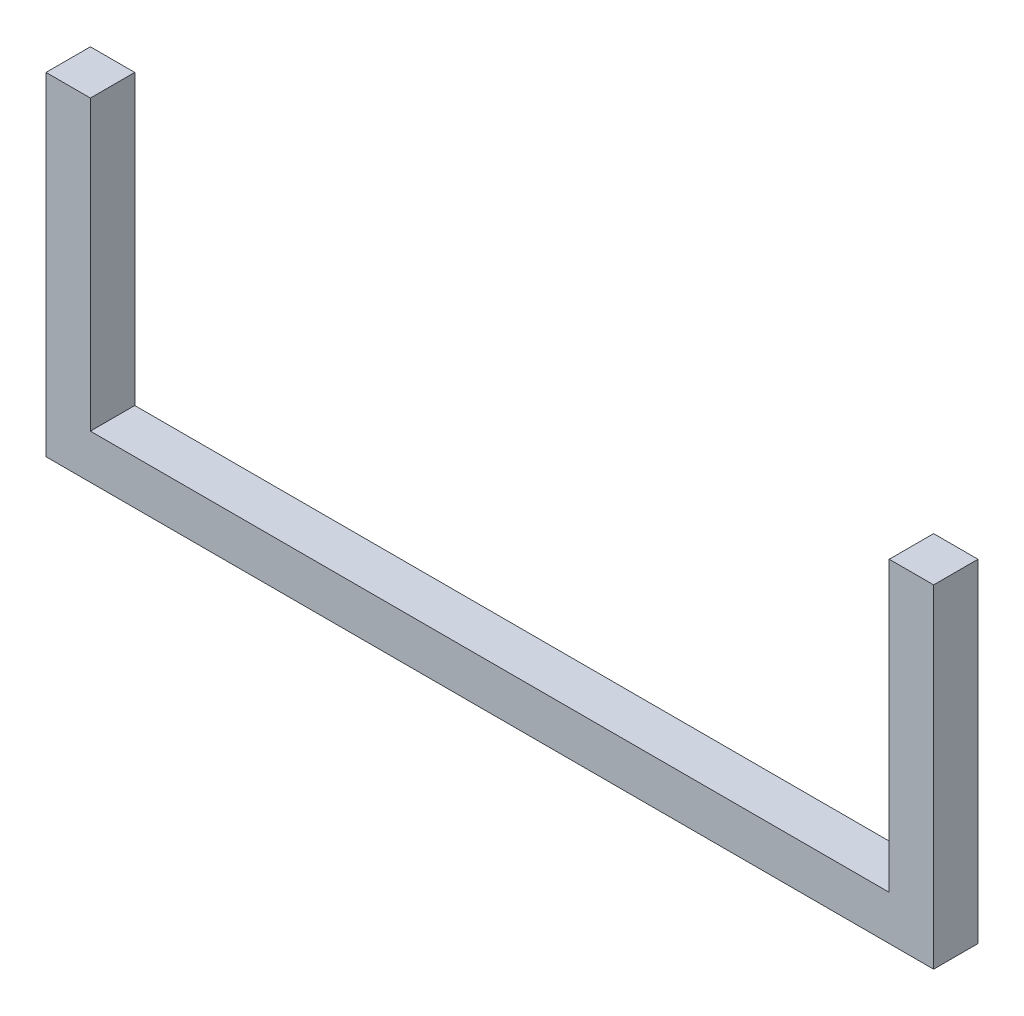
ISO-10303-21;
HEADER;
FILE_DESCRIPTION(('STEP AP214'),'2;1');
FILE_NAME('part.step','',(''),(''),'','','');
FILE_SCHEMA(('AUTOMOTIVE_DESIGN { 1 0 10303 214 1 1 1 1 }'));
ENDSEC;
DATA;
#1=APPLICATION_CONTEXT('core data for automotive mechanical design processes');
#2=APPLICATION_PROTOCOL_DEFINITION('international standard','automotive_design',2000,#1);
#3=PRODUCT_CONTEXT('',#1,'mechanical');
#4=PRODUCT('Part','Part','',(#3));
#5=PRODUCT_RELATED_PRODUCT_CATEGORY('part','',(#4));
#6=PRODUCT_DEFINITION_FORMATION('','',#4);
#7=PRODUCT_DEFINITION_CONTEXT('part definition',#1,'design');
#8=PRODUCT_DEFINITION('design','',#6,#7);
#9=PRODUCT_DEFINITION_SHAPE('','',#8);
#10=(LENGTH_UNIT() NAMED_UNIT(*) SI_UNIT(.MILLI.,.METRE.));
#11=(NAMED_UNIT(*) PLANE_ANGLE_UNIT() SI_UNIT($,.RADIAN.));
#12=(NAMED_UNIT(*) SI_UNIT($,.STERADIAN.) SOLID_ANGLE_UNIT());
#13=UNCERTAINTY_MEASURE_WITH_UNIT(LENGTH_MEASURE(1.E-05),#10,'distance_accuracy_value','');
#14=(GEOMETRIC_REPRESENTATION_CONTEXT(3) GLOBAL_UNCERTAINTY_ASSIGNED_CONTEXT((#13)) GLOBAL_UNIT_ASSIGNED_CONTEXT((#10,
#11,#12)) REPRESENTATION_CONTEXT('',''));
#15=CARTESIAN_POINT('',(0.,0.,0.));
#16=DIRECTION('',(0.,0.,1.));
#17=DIRECTION('',(1.,0.,0.));
#18=AXIS2_PLACEMENT_3D('',#15,#16,#17);
#19=CARTESIAN_POINT('',(0.,150.,20.));
#20=DIRECTION('',(-1.,0.,0.));
#21=DIRECTION('',(0.,-1.,0.));
#22=AXIS2_PLACEMENT_3D('',#19,#20,#21);
#23=PLANE('',#22);
#24=DIRECTION('',(0.,1.,0.));
#25=VECTOR('',#24,1.);
#26=CARTESIAN_POINT('',(0.,150.,0.));
#27=LINE('',#26,#25);
#28=CARTESIAN_POINT('',(0.,0.,0.));
#29=VERTEX_POINT('',#28);
#30=CARTESIAN_POINT('',(0.,150.,0.));
#31=VERTEX_POINT('',#30);
#32=EDGE_CURVE('E128',#29,#31,#27,.T.);
#33=ORIENTED_EDGE('',*,*,#32,.T.);
#34=DIRECTION('',(0.,0.,-1.));
#35=VECTOR('',#34,1.);
#36=CARTESIAN_POINT('',(0.,150.,20.));
#37=LINE('',#36,#35);
#38=CARTESIAN_POINT('',(0.,150.,20.));
#39=VERTEX_POINT('',#38);
#40=EDGE_CURVE('E11',#39,#31,#37,.T.);
#41=ORIENTED_EDGE('',*,*,#40,.F.);
#42=DIRECTION('',(0.,1.,0.));
#43=VECTOR('',#42,1.);
#44=CARTESIAN_POINT('',(0.,150.,20.));
#45=LINE('',#44,#43);
#46=CARTESIAN_POINT('',(0.,0.,20.));
#47=VERTEX_POINT('',#46);
#48=EDGE_CURVE('E142',#47,#39,#45,.T.);
#49=ORIENTED_EDGE('',*,*,#48,.F.);
#50=DIRECTION('',(0.,0.,-1.));
#51=VECTOR('',#50,1.);
#52=CARTESIAN_POINT('',(0.,0.,20.));
#53=LINE('',#52,#51);
#54=EDGE_CURVE('E124',#47,#29,#53,.T.);
#55=ORIENTED_EDGE('',*,*,#54,.T.);
#56=EDGE_LOOP('',(#33,#41,#49,#55));
#57=FACE_BOUND('',#56,.T.);
#58=ADVANCED_FACE('F32',(#57),#23,.F.);
#59=CARTESIAN_POINT('',(-20.,150.,20.));
#60=DIRECTION('',(0.,-1.,0.));
#61=DIRECTION('',(1.,0.,0.));
#62=AXIS2_PLACEMENT_3D('',#59,#60,#61);
#63=PLANE('',#62);
#64=DIRECTION('',(-1.,0.,0.));
#65=VECTOR('',#64,1.);
#66=CARTESIAN_POINT('',(-20.,150.,0.));
#67=LINE('',#66,#65);
#68=CARTESIAN_POINT('',(-20.,150.,0.));
#69=VERTEX_POINT('',#68);
#70=EDGE_CURVE('E131',#31,#69,#67,.T.);
#71=ORIENTED_EDGE('',*,*,#70,.T.);
#72=DIRECTION('',(0.,0.,-1.));
#73=VECTOR('',#72,1.);
#74=CARTESIAN_POINT('',(-20.,150.,20.));
#75=LINE('',#74,#73);
#76=CARTESIAN_POINT('',(-20.,150.,20.));
#77=VERTEX_POINT('',#76);
#78=EDGE_CURVE('E40',#77,#69,#75,.T.);
#79=ORIENTED_EDGE('',*,*,#78,.F.);
#80=DIRECTION('',(-1.,0.,0.));
#81=VECTOR('',#80,1.);
#82=CARTESIAN_POINT('',(-20.,150.,20.));
#83=LINE('',#82,#81);
#84=EDGE_CURVE('E91',#39,#77,#83,.T.);
#85=ORIENTED_EDGE('',*,*,#84,.F.);
#86=ORIENTED_EDGE('',*,*,#40,.T.);
#87=EDGE_LOOP('',(#71,#79,#85,#86));
#88=FACE_BOUND('',#87,.T.);
#89=ADVANCED_FACE('F177',(#88),#63,.F.);
#90=CARTESIAN_POINT('',(-20.,20.,20.));
#91=DIRECTION('',(1.,0.,0.));
#92=DIRECTION('',(0.,1.,0.));
#93=AXIS2_PLACEMENT_3D('',#90,#91,#92);
#94=PLANE('',#93);
#95=DIRECTION('',(0.,-1.,0.));
#96=VECTOR('',#95,1.);
#97=CARTESIAN_POINT('',(-20.,20.,0.));
#98=LINE('',#97,#96);
#99=CARTESIAN_POINT('',(-20.,20.,0.));
#100=VERTEX_POINT('',#99);
#101=EDGE_CURVE('E133',#69,#100,#98,.T.);
#102=ORIENTED_EDGE('',*,*,#101,.T.);
#103=DIRECTION('',(0.,0.,-1.));
#104=VECTOR('',#103,1.);
#105=CARTESIAN_POINT('',(-20.,20.,20.));
#106=LINE('',#105,#104);
#107=CARTESIAN_POINT('',(-20.,20.,20.));
#108=VERTEX_POINT('',#107);
#109=EDGE_CURVE('E149',#108,#100,#106,.T.);
#110=ORIENTED_EDGE('',*,*,#109,.F.);
#111=DIRECTION('',(0.,-1.,0.));
#112=VECTOR('',#111,1.);
#113=CARTESIAN_POINT('',(-20.,20.,20.));
#114=LINE('',#113,#112);
#115=EDGE_CURVE('E157',#77,#108,#114,.T.);
#116=ORIENTED_EDGE('',*,*,#115,.F.);
#117=ORIENTED_EDGE('',*,*,#78,.T.);
#118=EDGE_LOOP('',(#102,#110,#116,#117));
#119=FACE_BOUND('',#118,.T.);
#120=ADVANCED_FACE('F155',(#119),#94,.F.);
#121=CARTESIAN_POINT('',(-380.,20.,20.));
#122=DIRECTION('',(0.,-1.,0.));
#123=DIRECTION('',(1.,0.,0.));
#124=AXIS2_PLACEMENT_3D('',#121,#122,#123);
#125=PLANE('',#124);
#126=DIRECTION('',(-1.,0.,0.));
#127=VECTOR('',#126,1.);
#128=CARTESIAN_POINT('',(-380.,20.,0.));
#129=LINE('',#128,#127);
#130=CARTESIAN_POINT('',(-380.,20.,0.));
#131=VERTEX_POINT('',#130);
#132=EDGE_CURVE('E135',#100,#131,#129,.T.);
#133=ORIENTED_EDGE('',*,*,#132,.T.);
#134=DIRECTION('',(0.,0.,-1.));
#135=VECTOR('',#134,1.);
#136=CARTESIAN_POINT('',(-380.,20.,20.));
#137=LINE('',#136,#135);
#138=CARTESIAN_POINT('',(-380.,20.,20.));
#139=VERTEX_POINT('',#138);
#140=EDGE_CURVE('E146',#139,#131,#137,.T.);
#141=ORIENTED_EDGE('',*,*,#140,.F.);
#142=DIRECTION('',(-1.,0.,0.));
#143=VECTOR('',#142,1.);
#144=CARTESIAN_POINT('',(-380.,20.,20.));
#145=LINE('',#144,#143);
#146=EDGE_CURVE('E169',#108,#139,#145,.T.);
#147=ORIENTED_EDGE('',*,*,#146,.F.);
#148=ORIENTED_EDGE('',*,*,#109,.T.);
#149=EDGE_LOOP('',(#133,#141,#147,#148));
#150=FACE_BOUND('',#149,.T.);
#151=ADVANCED_FACE('F165',(#150),#125,.F.);
#152=CARTESIAN_POINT('',(-380.,150.,20.));
#153=DIRECTION('',(-1.,0.,0.));
#154=DIRECTION('',(0.,0.,1.));
#155=AXIS2_PLACEMENT_3D('',#152,#153,#154);
#156=PLANE('',#155);
#157=DIRECTION('',(0.,1.,0.));
#158=VECTOR('',#157,1.);
#159=CARTESIAN_POINT('',(-380.,150.,0.));
#160=LINE('',#159,#158);
#161=CARTESIAN_POINT('',(-380.,150.,0.));
#162=VERTEX_POINT('',#161);
#163=EDGE_CURVE('E137',#131,#162,#160,.T.);
#164=ORIENTED_EDGE('',*,*,#163,.T.);
#165=DIRECTION('',(0.,0.,-1.));
#166=VECTOR('',#165,1.);
#167=CARTESIAN_POINT('',(-380.,150.,20.));
#168=LINE('',#167,#166);
#169=CARTESIAN_POINT('',(-380.,150.,20.));
#170=VERTEX_POINT('',#169);
#171=EDGE_CURVE('E119',#170,#162,#168,.T.);
#172=ORIENTED_EDGE('',*,*,#171,.F.);
#173=DIRECTION('',(0.,1.,0.));
#174=VECTOR('',#173,1.);
#175=CARTESIAN_POINT('',(-380.,150.,20.));
#176=LINE('',#175,#174);
#177=EDGE_CURVE('E110',#139,#170,#176,.T.);
#178=ORIENTED_EDGE('',*,*,#177,.F.);
#179=ORIENTED_EDGE('',*,*,#140,.T.);
#180=EDGE_LOOP('',(#164,#172,#178,#179));
#181=FACE_BOUND('',#180,.T.);
#182=ADVANCED_FACE('F168',(#181),#156,.F.);
#183=CARTESIAN_POINT('',(-400.,150.,20.));
#184=DIRECTION('',(0.,-1.,0.));
#185=DIRECTION('',(0.,0.,-1.));
#186=AXIS2_PLACEMENT_3D('',#183,#184,#185);
#187=PLANE('',#186);
#188=DIRECTION('',(-1.,0.,0.));
#189=VECTOR('',#188,1.);
#190=CARTESIAN_POINT('',(-400.,150.,0.));
#191=LINE('',#190,#189);
#192=CARTESIAN_POINT('',(-400.,150.,0.));
#193=VERTEX_POINT('',#192);
#194=EDGE_CURVE('E118',#162,#193,#191,.T.);
#195=ORIENTED_EDGE('',*,*,#194,.T.);
#196=DIRECTION('',(0.,0.,-1.));
#197=VECTOR('',#196,1.);
#198=CARTESIAN_POINT('',(-400.,150.,20.));
#199=LINE('',#198,#197);
#200=CARTESIAN_POINT('',(-400.,150.,20.));
#201=VERTEX_POINT('',#200);
#202=EDGE_CURVE('E115',#201,#193,#199,.T.);
#203=ORIENTED_EDGE('',*,*,#202,.F.);
#204=DIRECTION('',(-1.,0.,0.));
#205=VECTOR('',#204,1.);
#206=CARTESIAN_POINT('',(-400.,150.,20.));
#207=LINE('',#206,#205);
#208=EDGE_CURVE('E104',#170,#201,#207,.T.);
#209=ORIENTED_EDGE('',*,*,#208,.F.);
#210=ORIENTED_EDGE('',*,*,#171,.T.);
#211=EDGE_LOOP('',(#195,#203,#209,#210));
#212=FACE_BOUND('',#211,.T.);
#213=ADVANCED_FACE('F116',(#212),#187,.F.);
#214=CARTESIAN_POINT('',(-400.,0.,20.));
#215=DIRECTION('',(1.,0.,0.));
#216=DIRECTION('',(0.,0.,-1.));
#217=AXIS2_PLACEMENT_3D('',#214,#215,#216);
#218=PLANE('',#217);
#219=DIRECTION('',(0.,-1.,0.));
#220=VECTOR('',#219,1.);
#221=CARTESIAN_POINT('',(-400.,0.,0.));
#222=LINE('',#221,#220);
#223=CARTESIAN_POINT('',(-400.,0.,0.));
#224=VERTEX_POINT('',#223);
#225=EDGE_CURVE('E77',#193,#224,#222,.T.);
#226=ORIENTED_EDGE('',*,*,#225,.T.);
#227=DIRECTION('',(0.,0.,-1.));
#228=VECTOR('',#227,1.);
#229=CARTESIAN_POINT('',(-400.,0.,20.));
#230=LINE('',#229,#228);
#231=CARTESIAN_POINT('',(-400.,0.,20.));
#232=VERTEX_POINT('',#231);
#233=EDGE_CURVE('E120',#232,#224,#230,.T.);
#234=ORIENTED_EDGE('',*,*,#233,.F.);
#235=DIRECTION('',(0.,-1.,0.));
#236=VECTOR('',#235,1.);
#237=CARTESIAN_POINT('',(-400.,0.,20.));
#238=LINE('',#237,#236);
#239=EDGE_CURVE('E108',#201,#232,#238,.T.);
#240=ORIENTED_EDGE('',*,*,#239,.F.);
#241=ORIENTED_EDGE('',*,*,#202,.T.);
#242=EDGE_LOOP('',(#226,#234,#240,#241));
#243=FACE_BOUND('',#242,.T.);
#244=ADVANCED_FACE('F122',(#243),#218,.F.);
#245=CARTESIAN_POINT('',(0.,0.,20.));
#246=DIRECTION('',(0.,1.,0.));
#247=DIRECTION('',(-1.,0.,0.));
#248=AXIS2_PLACEMENT_3D('',#245,#246,#247);
#249=PLANE('',#248);
#250=DIRECTION('',(1.,0.,0.));
#251=VECTOR('',#250,1.);
#252=CARTESIAN_POINT('',(0.,0.,0.));
#253=LINE('',#252,#251);
#254=EDGE_CURVE('E83',#224,#29,#253,.T.);
#255=ORIENTED_EDGE('',*,*,#254,.T.);
#256=ORIENTED_EDGE('',*,*,#54,.F.);
#257=DIRECTION('',(1.,0.,0.));
#258=VECTOR('',#257,1.);
#259=CARTESIAN_POINT('',(0.,0.,20.));
#260=LINE('',#259,#258);
#261=EDGE_CURVE('E48',#232,#47,#260,.T.);
#262=ORIENTED_EDGE('',*,*,#261,.F.);
#263=ORIENTED_EDGE('',*,*,#233,.T.);
#264=EDGE_LOOP('',(#255,#256,#262,#263));
#265=FACE_BOUND('',#264,.T.);
#266=ADVANCED_FACE('F193',(#265),#249,.F.);
#267=CARTESIAN_POINT('',(0.,0.,20.));
#268=DIRECTION('',(0.,0.,-1.));
#269=DIRECTION('',(-1.,0.,0.));
#270=AXIS2_PLACEMENT_3D('',#267,#268,#269);
#271=PLANE('',#270);
#272=ORIENTED_EDGE('',*,*,#48,.T.);
#273=ORIENTED_EDGE('',*,*,#84,.T.);
#274=ORIENTED_EDGE('',*,*,#115,.T.);
#275=ORIENTED_EDGE('',*,*,#146,.T.);
#276=ORIENTED_EDGE('',*,*,#177,.T.);
#277=ORIENTED_EDGE('',*,*,#208,.T.);
#278=ORIENTED_EDGE('',*,*,#239,.T.);
#279=ORIENTED_EDGE('',*,*,#261,.T.);
#280=EDGE_LOOP('',(#272,#273,#274,#275,#276,#277,#278,#279));
#281=FACE_BOUND('',#280,.T.);
#282=ADVANCED_FACE('F106',(#281),#271,.F.);
#283=CARTESIAN_POINT('',(0.,0.,0.));
#284=DIRECTION('',(0.,0.,-1.));
#285=DIRECTION('',(-1.,0.,0.));
#286=AXIS2_PLACEMENT_3D('',#283,#284,#285);
#287=PLANE('',#286);
#288=ORIENTED_EDGE('',*,*,#32,.F.);
#289=ORIENTED_EDGE('',*,*,#254,.F.);
#290=ORIENTED_EDGE('',*,*,#225,.F.);
#291=ORIENTED_EDGE('',*,*,#194,.F.);
#292=ORIENTED_EDGE('',*,*,#163,.F.);
#293=ORIENTED_EDGE('',*,*,#132,.F.);
#294=ORIENTED_EDGE('',*,*,#101,.F.);
#295=ORIENTED_EDGE('',*,*,#70,.F.);
#296=EDGE_LOOP('',(#288,#289,#290,#291,#292,#293,#294,#295));
#297=FACE_BOUND('',#296,.T.);
#298=ADVANCED_FACE('F161',(#297),#287,.T.);
#299=CLOSED_SHELL('',(#58,#89,#120,#151,#182,#213,#244,#266,#282,#298));
#300=MANIFOLD_SOLID_BREP('B2',#299);
#301=ADVANCED_BREP_SHAPE_REPRESENTATION('',(#18,#300),#14);
#302=SHAPE_DEFINITION_REPRESENTATION(#9,#301);
ENDSEC;
END-ISO-10303-21;
